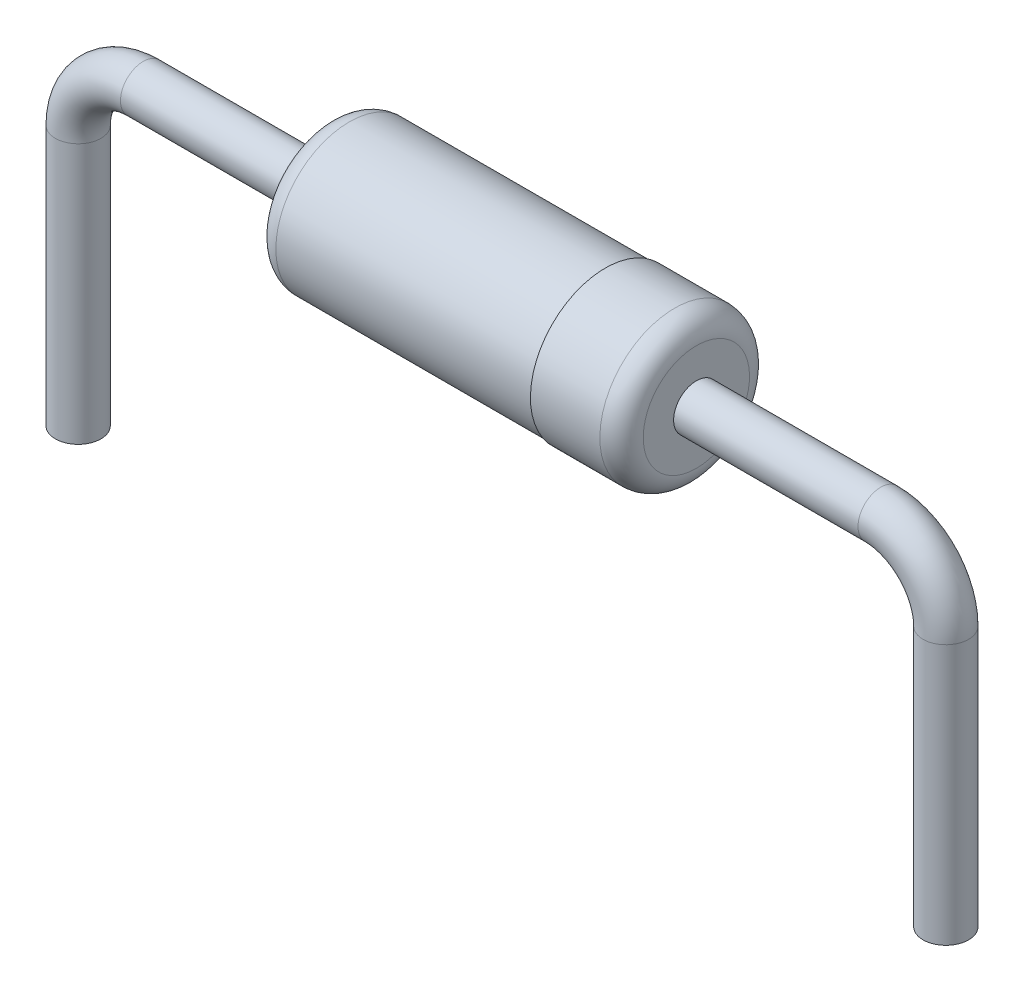
ISO-10303-21;
HEADER;
FILE_DESCRIPTION(('STEP AP214'),'2;1');
FILE_NAME('part.step','',(''),(''),'','','');
FILE_SCHEMA(('AUTOMOTIVE_DESIGN { 1 0 10303 214 1 1 1 1 }'));
ENDSEC;
DATA;
#1=APPLICATION_CONTEXT('core data for automotive mechanical design processes');
#2=APPLICATION_PROTOCOL_DEFINITION('international standard','automotive_design',2000,#1);
#3=PRODUCT_CONTEXT('',#1,'mechanical');
#4=PRODUCT('Part','Part','',(#3));
#5=PRODUCT_RELATED_PRODUCT_CATEGORY('part','',(#4));
#6=PRODUCT_DEFINITION_FORMATION('','',#4);
#7=PRODUCT_DEFINITION_CONTEXT('part definition',#1,'design');
#8=PRODUCT_DEFINITION('design','',#6,#7);
#9=PRODUCT_DEFINITION_SHAPE('','',#8);
#10=(LENGTH_UNIT() NAMED_UNIT(*) SI_UNIT(.MILLI.,.METRE.));
#11=(NAMED_UNIT(*) PLANE_ANGLE_UNIT() SI_UNIT($,.RADIAN.));
#12=(NAMED_UNIT(*) SI_UNIT($,.STERADIAN.) SOLID_ANGLE_UNIT());
#13=UNCERTAINTY_MEASURE_WITH_UNIT(LENGTH_MEASURE(1.E-05),#10,'distance_accuracy_value','');
#14=(GEOMETRIC_REPRESENTATION_CONTEXT(3) GLOBAL_UNCERTAINTY_ASSIGNED_CONTEXT((#13)) GLOBAL_UNIT_ASSIGNED_CONTEXT((#10,
#11,#12)) REPRESENTATION_CONTEXT('',''));
#15=CARTESIAN_POINT('',(0.,0.,0.));
#16=DIRECTION('',(0.,0.,1.));
#17=DIRECTION('',(1.,0.,0.));
#18=AXIS2_PLACEMENT_3D('',#15,#16,#17);
#19=CARTESIAN_POINT('',(0.762,1.27,0.));
#20=DIRECTION('',(1.,0.,0.));
#21=DIRECTION('',(0.,0.,-1.));
#22=AXIS2_PLACEMENT_3D('',#19,#20,#21);
#23=CYLINDRICAL_SURFACE('',#22,0.2665);
#24=CARTESIAN_POINT('',(0.762,1.27,0.));
#25=DIRECTION('',(1.,0.,0.));
#26=DIRECTION('',(0.,0.,1.));
#27=AXIS2_PLACEMENT_3D('',#24,#25,#26);
#28=CIRCLE('',#27,0.2665);
#29=CARTESIAN_POINT('',(0.762,1.5365,0.));
#30=VERTEX_POINT('',#29);
#31=EDGE_CURVE('E57',#30,#30,#28,.T.);
#32=ORIENTED_EDGE('',*,*,#31,.T.);
#33=EDGE_LOOP('',(#32));
#34=FACE_BOUND('',#33,.T.);
#35=CARTESIAN_POINT('',(2.921,1.27,0.));
#36=DIRECTION('',(1.,0.,0.));
#37=DIRECTION('',(0.,0.,1.));
#38=AXIS2_PLACEMENT_3D('',#35,#36,#37);
#39=CIRCLE('',#38,0.2665);
#40=CARTESIAN_POINT('',(2.921,1.27,0.2665));
#41=VERTEX_POINT('',#40);
#42=EDGE_CURVE('E49',#41,#41,#39,.T.);
#43=ORIENTED_EDGE('',*,*,#42,.F.);
#44=EDGE_LOOP('',(#43));
#45=FACE_BOUND('',#44,.T.);
#46=ADVANCED_FACE('F29',(#34,#45),#23,.T.);
#47=CARTESIAN_POINT('',(0.762,0.508,0.));
#48=DIRECTION('',(0.,0.,-1.));
#49=DIRECTION('',(-1.,0.,0.));
#50=AXIS2_PLACEMENT_3D('',#47,#48,#49);
#51=TOROIDAL_SURFACE('',#50,0.762,0.2665);
#52=CARTESIAN_POINT('',(0.,0.508,0.));
#53=DIRECTION('',(0.,1.,0.));
#54=DIRECTION('',(0.,0.,1.));
#55=AXIS2_PLACEMENT_3D('',#52,#53,#54);
#56=CIRCLE('',#55,0.2665);
#57=CARTESIAN_POINT('',(-0.2665,0.508,0.));
#58=VERTEX_POINT('',#57);
#59=EDGE_CURVE('E60',#58,#58,#56,.T.);
#60=CARTESIAN_POINT('',(0.762,0.508,0.));
#61=DIRECTION('',(0.,0.,-1.));
#62=DIRECTION('',(-1.,0.,0.));
#63=AXIS2_PLACEMENT_3D('',#60,#61,#62);
#64=CIRCLE('',#63,1.0285);
#65=EDGE_CURVE('',#58,#30,#64,.T.);
#66=ORIENTED_EDGE('',*,*,#59,.T.);
#67=ORIENTED_EDGE('',*,*,#31,.F.);
#68=ORIENTED_EDGE('',*,*,#65,.T.);
#69=ORIENTED_EDGE('',*,*,#65,.F.);
#70=EDGE_LOOP('',(#66,#68,#67,#69));
#71=FACE_BOUND('',#70,.T.);
#72=ADVANCED_FACE('F99',(#71),#51,.T.);
#73=CARTESIAN_POINT('',(0.,0.508,0.));
#74=DIRECTION('',(0.,-1.,0.));
#75=DIRECTION('',(0.,0.,-1.));
#76=AXIS2_PLACEMENT_3D('',#73,#74,#75);
#77=CYLINDRICAL_SURFACE('',#76,0.2665);
#78=ORIENTED_EDGE('',*,*,#59,.F.);
#79=EDGE_LOOP('',(#78));
#80=FACE_BOUND('',#79,.T.);
#81=CARTESIAN_POINT('',(0.,-2.54,0.));
#82=DIRECTION('',(0.,1.,0.));
#83=DIRECTION('',(0.,0.,1.));
#84=AXIS2_PLACEMENT_3D('',#81,#82,#83);
#85=CIRCLE('',#84,0.2665);
#86=CARTESIAN_POINT('',(0.,-2.54,0.2665));
#87=VERTEX_POINT('',#86);
#88=EDGE_CURVE('E61',#87,#87,#85,.T.);
#89=ORIENTED_EDGE('',*,*,#88,.T.);
#90=EDGE_LOOP('',(#89));
#91=FACE_BOUND('',#90,.T.);
#92=ADVANCED_FACE('F105',(#80,#91),#77,.T.);
#93=CARTESIAN_POINT('',(0.,-2.54,0.));
#94=DIRECTION('',(0.,1.,0.));
#95=DIRECTION('',(0.,0.,1.));
#96=AXIS2_PLACEMENT_3D('',#93,#94,#95);
#97=PLANE('',#96);
#98=ORIENTED_EDGE('',*,*,#88,.F.);
#99=EDGE_LOOP('',(#98));
#100=FACE_BOUND('',#99,.T.);
#101=ADVANCED_FACE('F144',(#100),#97,.F.);
#102=CARTESIAN_POINT('',(5.08,1.27000000000001,0.));
#103=DIRECTION('',(-1.,0.,0.));
#104=DIRECTION('',(0.,-1.,0.));
#105=AXIS2_PLACEMENT_3D('',#102,#103,#104);
#106=CYLINDRICAL_SURFACE('',#105,0.86);
#107=CARTESIAN_POINT('',(3.175,1.27,0.));
#108=DIRECTION('',(1.,0.,0.));
#109=DIRECTION('',(0.,1.,0.));
#110=AXIS2_PLACEMENT_3D('',#107,#108,#109);
#111=CIRCLE('',#110,0.86);
#112=CARTESIAN_POINT('',(3.17499999999999,2.13,0.));
#113=VERTEX_POINT('',#112);
#114=EDGE_CURVE('E36',#113,#113,#111,.T.);
#115=ORIENTED_EDGE('',*,*,#114,.T.);
#116=EDGE_LOOP('',(#115));
#117=FACE_BOUND('',#116,.T.);
#118=CARTESIAN_POINT('',(6.1722,1.27000000000001,0.));
#119=DIRECTION('',(-1.,0.,0.));
#120=DIRECTION('',(0.,-1.,0.));
#121=AXIS2_PLACEMENT_3D('',#118,#119,#120);
#122=CIRCLE('',#121,0.86);
#123=CARTESIAN_POINT('',(6.1722,0.41000000000001,0.));
#124=VERTEX_POINT('',#123);
#125=EDGE_CURVE('E50',#124,#124,#122,.T.);
#126=ORIENTED_EDGE('',*,*,#125,.T.);
#127=EDGE_LOOP('',(#126));
#128=FACE_BOUND('',#127,.T.);
#129=ADVANCED_FACE('F141',(#117,#128),#106,.T.);
#130=CARTESIAN_POINT('',(2.921,1.27,0.));
#131=DIRECTION('',(1.,0.,0.));
#132=DIRECTION('',(0.,1.,0.));
#133=AXIS2_PLACEMENT_3D('',#130,#131,#132);
#134=PLANE('',#133);
#135=CARTESIAN_POINT('',(2.921,1.27,0.));
#136=DIRECTION('',(1.,0.,0.));
#137=DIRECTION('',(0.,1.,0.));
#138=AXIS2_PLACEMENT_3D('',#135,#136,#137);
#139=CIRCLE('',#138,0.606);
#140=CARTESIAN_POINT('',(2.92099999999999,1.876,0.));
#141=VERTEX_POINT('',#140);
#142=EDGE_CURVE('E10',#141,#141,#139,.F.);
#143=ORIENTED_EDGE('',*,*,#142,.T.);
#144=EDGE_LOOP('',(#143));
#145=FACE_BOUND('',#144,.T.);
#146=ORIENTED_EDGE('',*,*,#42,.T.);
#147=EDGE_LOOP('',(#146));
#148=FACE_BOUND('',#147,.T.);
#149=ADVANCED_FACE('F95',(#145,#148),#134,.F.);
#150=CARTESIAN_POINT('',(6.1722,1.27000000000002,0.));
#151=DIRECTION('',(-1.,0.,0.));
#152=DIRECTION('',(0.,-1.,0.));
#153=AXIS2_PLACEMENT_3D('',#150,#151,#152);
#154=PLANE('',#153);
#155=CARTESIAN_POINT('',(6.1722,1.27000000000002,0.));
#156=DIRECTION('',(-1.,0.,0.));
#157=DIRECTION('',(0.,-1.,0.));
#158=AXIS2_PLACEMENT_3D('',#155,#156,#157);
#159=CIRCLE('',#158,0.8763);
#160=CARTESIAN_POINT('',(6.1722,0.393700000000017,0.));
#161=VERTEX_POINT('',#160);
#162=EDGE_CURVE('E54',#161,#161,#159,.T.);
#163=ORIENTED_EDGE('',*,*,#162,.T.);
#164=EDGE_LOOP('',(#163));
#165=FACE_BOUND('',#164,.T.);
#166=ORIENTED_EDGE('',*,*,#125,.F.);
#167=EDGE_LOOP('',(#166));
#168=FACE_BOUND('',#167,.T.);
#169=ADVANCED_FACE('F80',(#165,#168),#154,.T.);
#170=CARTESIAN_POINT('',(6.1722,1.27000000000002,0.));
#171=DIRECTION('',(1.,0.,0.));
#172=DIRECTION('',(0.,1.,0.));
#173=AXIS2_PLACEMENT_3D('',#170,#171,#172);
#174=CYLINDRICAL_SURFACE('',#173,0.8763);
#175=CARTESIAN_POINT('',(6.985,1.27000000000002,0.));
#176=DIRECTION('',(-1.,0.,0.));
#177=DIRECTION('',(0.,-1.,0.));
#178=AXIS2_PLACEMENT_3D('',#175,#176,#177);
#179=CIRCLE('',#178,0.8763);
#180=CARTESIAN_POINT('',(6.985,0.39370000000002,0.));
#181=VERTEX_POINT('',#180);
#182=EDGE_CURVE('E44',#181,#181,#179,.T.);
#183=ORIENTED_EDGE('',*,*,#182,.T.);
#184=EDGE_LOOP('',(#183));
#185=FACE_BOUND('',#184,.T.);
#186=ORIENTED_EDGE('',*,*,#162,.F.);
#187=EDGE_LOOP('',(#186));
#188=FACE_BOUND('',#187,.T.);
#189=ADVANCED_FACE('F83',(#185,#188),#174,.T.);
#190=CARTESIAN_POINT('',(10.16,-2.53999999999997,0.));
#191=DIRECTION('',(0.,1.,0.));
#192=DIRECTION('',(0.,0.,1.));
#193=AXIS2_PLACEMENT_3D('',#190,#191,#192);
#194=PLANE('',#193);
#195=CARTESIAN_POINT('',(10.16,-2.53999999999997,0.));
#196=DIRECTION('',(0.,-1.,0.));
#197=DIRECTION('',(0.,0.,1.));
#198=AXIS2_PLACEMENT_3D('',#195,#196,#197);
#199=CIRCLE('',#198,0.2665);
#200=CARTESIAN_POINT('',(10.16,-2.53999999999997,0.2665));
#201=VERTEX_POINT('',#200);
#202=EDGE_CURVE('E53',#201,#201,#199,.T.);
#203=ORIENTED_EDGE('',*,*,#202,.T.);
#204=EDGE_LOOP('',(#203));
#205=FACE_BOUND('',#204,.T.);
#206=ADVANCED_FACE('F85',(#205),#194,.F.);
#207=CARTESIAN_POINT('',(10.16,0.508000000000033,0.));
#208=DIRECTION('',(0.,-1.,0.));
#209=DIRECTION('',(0.,0.,-1.));
#210=AXIS2_PLACEMENT_3D('',#207,#208,#209);
#211=CYLINDRICAL_SURFACE('',#210,0.2665);
#212=CARTESIAN_POINT('',(10.16,0.508000000000033,0.));
#213=DIRECTION('',(0.,-1.,0.));
#214=DIRECTION('',(0.,0.,1.));
#215=AXIS2_PLACEMENT_3D('',#212,#213,#214);
#216=CIRCLE('',#215,0.2665);
#217=CARTESIAN_POINT('',(10.4265,0.508000000000035,0.));
#218=VERTEX_POINT('',#217);
#219=EDGE_CURVE('E72',#218,#218,#216,.T.);
#220=ORIENTED_EDGE('',*,*,#219,.T.);
#221=EDGE_LOOP('',(#220));
#222=FACE_BOUND('',#221,.T.);
#223=ORIENTED_EDGE('',*,*,#202,.F.);
#224=EDGE_LOOP('',(#223));
#225=FACE_BOUND('',#224,.T.);
#226=ADVANCED_FACE('F92',(#222,#225),#211,.T.);
#227=CARTESIAN_POINT('',(9.398,0.508000000000028,0.));
#228=DIRECTION('',(0.,0.,-1.));
#229=DIRECTION('',(1.,0.,0.));
#230=AXIS2_PLACEMENT_3D('',#227,#228,#229);
#231=TOROIDAL_SURFACE('',#230,0.762,0.2665);
#232=CARTESIAN_POINT('',(9.39799999999999,1.27000000000003,0.));
#233=DIRECTION('',(1.,0.,0.));
#234=DIRECTION('',(0.,0.,1.));
#235=AXIS2_PLACEMENT_3D('',#232,#233,#234);
#236=CIRCLE('',#235,0.2665);
#237=CARTESIAN_POINT('',(9.39799999999999,1.53650000000003,0.));
#238=VERTEX_POINT('',#237);
#239=EDGE_CURVE('E69',#238,#238,#236,.T.);
#240=CARTESIAN_POINT('',(9.398,0.508000000000028,0.));
#241=DIRECTION('',(0.,0.,-1.));
#242=DIRECTION('',(1.,0.,0.));
#243=AXIS2_PLACEMENT_3D('',#240,#241,#242);
#244=CIRCLE('',#243,1.0285);
#245=EDGE_CURVE('',#238,#218,#244,.T.);
#246=ORIENTED_EDGE('',*,*,#239,.T.);
#247=ORIENTED_EDGE('',*,*,#219,.F.);
#248=ORIENTED_EDGE('',*,*,#245,.T.);
#249=ORIENTED_EDGE('',*,*,#245,.F.);
#250=EDGE_LOOP('',(#246,#248,#247,#249));
#251=FACE_BOUND('',#250,.T.);
#252=ADVANCED_FACE('F128',(#251),#231,.T.);
#253=CARTESIAN_POINT('',(9.39799999999999,1.27000000000003,0.));
#254=DIRECTION('',(-1.,0.,0.));
#255=DIRECTION('',(0.,0.,-1.));
#256=AXIS2_PLACEMENT_3D('',#253,#254,#255);
#257=CYLINDRICAL_SURFACE('',#256,0.2665);
#258=ORIENTED_EDGE('',*,*,#239,.F.);
#259=EDGE_LOOP('',(#258));
#260=FACE_BOUND('',#259,.T.);
#261=CARTESIAN_POINT('',(7.23899999999999,1.27000000000001,0.));
#262=DIRECTION('',(1.,0.,0.));
#263=DIRECTION('',(0.,0.,1.));
#264=AXIS2_PLACEMENT_3D('',#261,#262,#263);
#265=CIRCLE('',#264,0.2665);
#266=CARTESIAN_POINT('',(7.23899999999999,1.27000000000001,0.2665));
#267=VERTEX_POINT('',#266);
#268=EDGE_CURVE('E64',#267,#267,#265,.T.);
#269=ORIENTED_EDGE('',*,*,#268,.T.);
#270=EDGE_LOOP('',(#269));
#271=FACE_BOUND('',#270,.T.);
#272=ADVANCED_FACE('F119',(#260,#271),#257,.T.);
#273=CARTESIAN_POINT('',(7.239,1.27000000000001,0.));
#274=DIRECTION('',(-1.,0.,0.));
#275=DIRECTION('',(0.,1.,0.));
#276=AXIS2_PLACEMENT_3D('',#273,#274,#275);
#277=PLANE('',#276);
#278=CARTESIAN_POINT('',(7.239,1.27000000000002,0.));
#279=DIRECTION('',(-1.,0.,0.));
#280=DIRECTION('',(0.,-1.,0.));
#281=AXIS2_PLACEMENT_3D('',#278,#279,#280);
#282=CIRCLE('',#281,0.6223);
#283=CARTESIAN_POINT('',(7.239,0.647700000000021,0.));
#284=VERTEX_POINT('',#283);
#285=EDGE_CURVE('E40',#284,#284,#282,.F.);
#286=ORIENTED_EDGE('',*,*,#285,.T.);
#287=EDGE_LOOP('',(#286));
#288=FACE_BOUND('',#287,.T.);
#289=ORIENTED_EDGE('',*,*,#268,.F.);
#290=EDGE_LOOP('',(#289));
#291=FACE_BOUND('',#290,.T.);
#292=ADVANCED_FACE('F112',(#288,#291),#277,.F.);
#293=CARTESIAN_POINT('',(6.985,1.27000000000002,0.));
#294=DIRECTION('',(-1.,0.,0.));
#295=DIRECTION('',(0.,-1.,0.));
#296=AXIS2_PLACEMENT_3D('',#293,#294,#295);
#297=TOROIDAL_SURFACE('',#296,0.6223,0.254);
#298=ORIENTED_EDGE('',*,*,#285,.F.);
#299=EDGE_LOOP('',(#298));
#300=FACE_BOUND('',#299,.T.);
#301=ORIENTED_EDGE('',*,*,#182,.F.);
#302=EDGE_LOOP('',(#301));
#303=FACE_BOUND('',#302,.T.);
#304=ADVANCED_FACE('F110',(#300,#303),#297,.T.);
#305=CARTESIAN_POINT('',(3.175,1.27,0.));
#306=DIRECTION('',(1.,0.,0.));
#307=DIRECTION('',(0.,1.,0.));
#308=AXIS2_PLACEMENT_3D('',#305,#306,#307);
#309=TOROIDAL_SURFACE('',#308,0.606,0.254);
#310=ORIENTED_EDGE('',*,*,#142,.F.);
#311=EDGE_LOOP('',(#310));
#312=FACE_BOUND('',#311,.T.);
#313=ORIENTED_EDGE('',*,*,#114,.F.);
#314=EDGE_LOOP('',(#313));
#315=FACE_BOUND('',#314,.T.);
#316=ADVANCED_FACE('F31',(#312,#315),#309,.T.);
#317=CLOSED_SHELL('',(#46,#72,#92,#101,#129,#149,#169,#189,#206,#226,#252,#272,#292,#304,#316));
#318=MANIFOLD_SOLID_BREP('B2',#317);
#319=ADVANCED_BREP_SHAPE_REPRESENTATION('',(#18,#318),#14);
#320=SHAPE_DEFINITION_REPRESENTATION(#9,#319);
ENDSEC;
END-ISO-10303-21;
